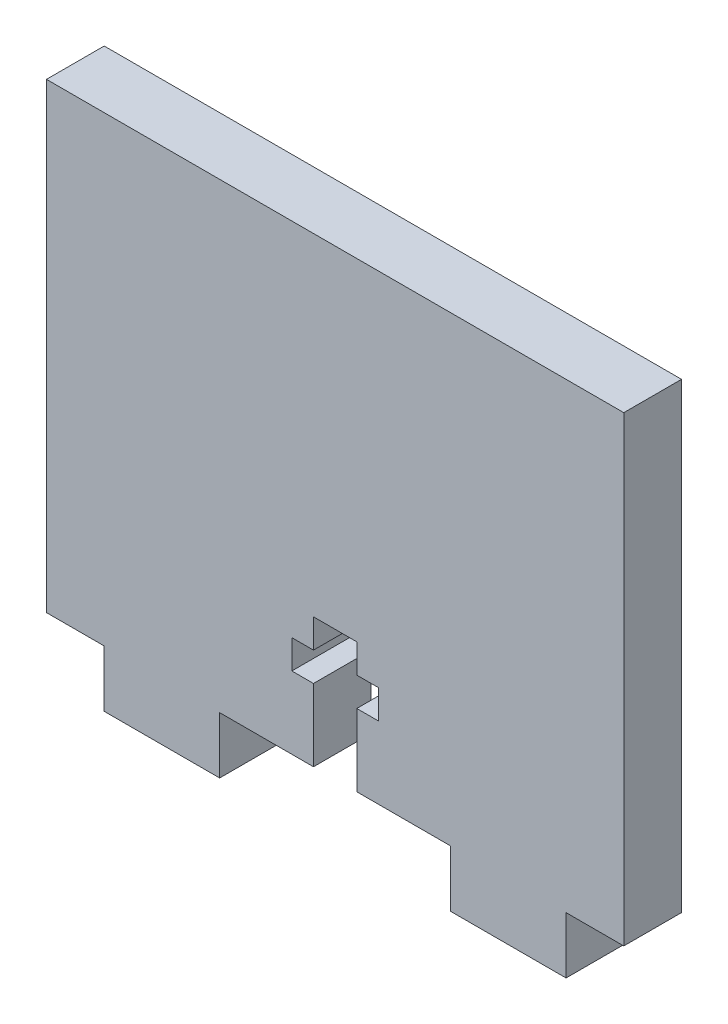
ISO-10303-21;
HEADER;
FILE_DESCRIPTION(('STEP AP214'),'2;1');
FILE_NAME('part.step','',(''),(''),'','','');
FILE_SCHEMA(('AUTOMOTIVE_DESIGN { 1 0 10303 214 1 1 1 1 }'));
ENDSEC;
DATA;
#1=APPLICATION_CONTEXT('core data for automotive mechanical design processes');
#2=APPLICATION_PROTOCOL_DEFINITION('international standard','automotive_design',2000,#1);
#3=PRODUCT_CONTEXT('',#1,'mechanical');
#4=PRODUCT('Part','Part','',(#3));
#5=PRODUCT_RELATED_PRODUCT_CATEGORY('part','',(#4));
#6=PRODUCT_DEFINITION_FORMATION('','',#4);
#7=PRODUCT_DEFINITION_CONTEXT('part definition',#1,'design');
#8=PRODUCT_DEFINITION('design','',#6,#7);
#9=PRODUCT_DEFINITION_SHAPE('','',#8);
#10=(LENGTH_UNIT() NAMED_UNIT(*) SI_UNIT(.MILLI.,.METRE.));
#11=(NAMED_UNIT(*) PLANE_ANGLE_UNIT() SI_UNIT($,.RADIAN.));
#12=(NAMED_UNIT(*) SI_UNIT($,.STERADIAN.) SOLID_ANGLE_UNIT());
#13=UNCERTAINTY_MEASURE_WITH_UNIT(LENGTH_MEASURE(1.E-05),#10,'distance_accuracy_value','');
#14=(GEOMETRIC_REPRESENTATION_CONTEXT(3) GLOBAL_UNCERTAINTY_ASSIGNED_CONTEXT((#13)) GLOBAL_UNIT_ASSIGNED_CONTEXT((#10,
#11,#12)) REPRESENTATION_CONTEXT('',''));
#15=CARTESIAN_POINT('',(0.,0.,0.));
#16=DIRECTION('',(0.,0.,1.));
#17=DIRECTION('',(1.,0.,0.));
#18=AXIS2_PLACEMENT_3D('',#15,#16,#17);
#19=CARTESIAN_POINT('',(0.,11.1125,6.35));
#20=DIRECTION('',(0.,-1.,0.));
#21=DIRECTION('',(0.,0.,-1.));
#22=AXIS2_PLACEMENT_3D('',#19,#20,#21);
#23=PLANE('',#22);
#24=DIRECTION('',(-1.,0.,0.));
#25=VECTOR('',#24,1.);
#26=CARTESIAN_POINT('',(0.,11.1125,0.));
#27=LINE('',#26,#25);
#28=CARTESIAN_POINT('',(29.36875,11.1125,0.));
#29=VERTEX_POINT('',#28);
#30=CARTESIAN_POINT('',(26.9875,11.1125,0.));
#31=VERTEX_POINT('',#30);
#32=EDGE_CURVE('E225',#29,#31,#27,.T.);
#33=ORIENTED_EDGE('',*,*,#32,.F.);
#34=DIRECTION('',(0.,0.,-1.));
#35=VECTOR('',#34,1.);
#36=CARTESIAN_POINT('',(29.36875,11.1125,6.35));
#37=LINE('',#36,#35);
#38=CARTESIAN_POINT('',(29.36875,11.1125,6.35));
#39=VERTEX_POINT('',#38);
#40=EDGE_CURVE('E11',#39,#29,#37,.T.);
#41=ORIENTED_EDGE('',*,*,#40,.F.);
#42=DIRECTION('',(-1.,0.,0.));
#43=VECTOR('',#42,1.);
#44=CARTESIAN_POINT('',(0.,11.1125,6.35));
#45=LINE('',#44,#43);
#46=CARTESIAN_POINT('',(26.9875,11.1125,6.35));
#47=VERTEX_POINT('',#46);
#48=EDGE_CURVE('E287',#39,#47,#45,.T.);
#49=ORIENTED_EDGE('',*,*,#48,.T.);
#50=DIRECTION('',(0.,0.,-1.));
#51=VECTOR('',#50,1.);
#52=CARTESIAN_POINT('',(26.9875,11.1125,6.35));
#53=LINE('',#52,#51);
#54=EDGE_CURVE('E134',#47,#31,#53,.T.);
#55=ORIENTED_EDGE('',*,*,#54,.T.);
#56=EDGE_LOOP('',(#33,#41,#49,#55));
#57=FACE_BOUND('',#56,.T.);
#58=ADVANCED_FACE('F35',(#57),#23,.T.);
#59=CARTESIAN_POINT('',(29.36875,0.,6.35));
#60=DIRECTION('',(-1.,0.,0.));
#61=DIRECTION('',(0.,0.,1.));
#62=AXIS2_PLACEMENT_3D('',#59,#60,#61);
#63=PLANE('',#62);
#64=DIRECTION('',(0.,1.,0.));
#65=VECTOR('',#64,1.);
#66=CARTESIAN_POINT('',(29.36875,0.,0.));
#67=LINE('',#66,#65);
#68=CARTESIAN_POINT('',(29.36875,14.2875,0.));
#69=VERTEX_POINT('',#68);
#70=EDGE_CURVE('E228',#29,#69,#67,.T.);
#71=ORIENTED_EDGE('',*,*,#70,.T.);
#72=DIRECTION('',(0.,0.,-1.));
#73=VECTOR('',#72,1.);
#74=CARTESIAN_POINT('',(29.36875,14.2875,6.35));
#75=LINE('',#74,#73);
#76=CARTESIAN_POINT('',(29.36875,14.2875,6.35));
#77=VERTEX_POINT('',#76);
#78=EDGE_CURVE('E43',#77,#69,#75,.T.);
#79=ORIENTED_EDGE('',*,*,#78,.F.);
#80=DIRECTION('',(0.,1.,0.));
#81=VECTOR('',#80,1.);
#82=CARTESIAN_POINT('',(29.36875,0.,6.35));
#83=LINE('',#82,#81);
#84=EDGE_CURVE('E351',#39,#77,#83,.T.);
#85=ORIENTED_EDGE('',*,*,#84,.F.);
#86=ORIENTED_EDGE('',*,*,#40,.T.);
#87=EDGE_LOOP('',(#71,#79,#85,#86));
#88=FACE_BOUND('',#87,.T.);
#89=ADVANCED_FACE('F340',(#88),#63,.F.);
#90=CARTESIAN_POINT('',(0.,14.2875,6.35));
#91=DIRECTION('',(0.,-1.,0.));
#92=DIRECTION('',(1.,0.,0.));
#93=AXIS2_PLACEMENT_3D('',#90,#91,#92);
#94=PLANE('',#93);
#95=DIRECTION('',(-1.,0.,0.));
#96=VECTOR('',#95,1.);
#97=CARTESIAN_POINT('',(0.,14.2875,0.));
#98=LINE('',#97,#96);
#99=CARTESIAN_POINT('',(34.13125,14.2875,0.));
#100=VERTEX_POINT('',#99);
#101=EDGE_CURVE('E231',#100,#69,#98,.T.);
#102=ORIENTED_EDGE('',*,*,#101,.F.);
#103=DIRECTION('',(0.,0.,-1.));
#104=VECTOR('',#103,1.);
#105=CARTESIAN_POINT('',(34.13125,14.2875,6.35));
#106=LINE('',#105,#104);
#107=CARTESIAN_POINT('',(34.13125,14.2875,6.35));
#108=VERTEX_POINT('',#107);
#109=EDGE_CURVE('E330',#108,#100,#106,.T.);
#110=ORIENTED_EDGE('',*,*,#109,.F.);
#111=DIRECTION('',(-1.,0.,0.));
#112=VECTOR('',#111,1.);
#113=CARTESIAN_POINT('',(0.,14.2875,6.35));
#114=LINE('',#113,#112);
#115=EDGE_CURVE('E337',#108,#77,#114,.T.);
#116=ORIENTED_EDGE('',*,*,#115,.T.);
#117=ORIENTED_EDGE('',*,*,#78,.T.);
#118=EDGE_LOOP('',(#102,#110,#116,#117));
#119=FACE_BOUND('',#118,.T.);
#120=ADVANCED_FACE('F335',(#119),#94,.T.);
#121=CARTESIAN_POINT('',(34.13125,0.,6.35));
#122=DIRECTION('',(-1.,0.,0.));
#123=DIRECTION('',(0.,0.,1.));
#124=AXIS2_PLACEMENT_3D('',#121,#122,#123);
#125=PLANE('',#124);
#126=DIRECTION('',(0.,1.,0.));
#127=VECTOR('',#126,1.);
#128=CARTESIAN_POINT('',(34.13125,0.,0.));
#129=LINE('',#128,#127);
#130=CARTESIAN_POINT('',(34.13125,11.1125,0.));
#131=VERTEX_POINT('',#130);
#132=EDGE_CURVE('E234',#131,#100,#129,.T.);
#133=ORIENTED_EDGE('',*,*,#132,.F.);
#134=DIRECTION('',(0.,0.,-1.));
#135=VECTOR('',#134,1.);
#136=CARTESIAN_POINT('',(34.13125,11.1125,6.35));
#137=LINE('',#136,#135);
#138=CARTESIAN_POINT('',(34.13125,11.1125,6.35));
#139=VERTEX_POINT('',#138);
#140=EDGE_CURVE('E328',#139,#131,#137,.T.);
#141=ORIENTED_EDGE('',*,*,#140,.F.);
#142=DIRECTION('',(0.,1.,0.));
#143=VECTOR('',#142,1.);
#144=CARTESIAN_POINT('',(34.13125,0.,6.35));
#145=LINE('',#144,#143);
#146=EDGE_CURVE('E350',#139,#108,#145,.T.);
#147=ORIENTED_EDGE('',*,*,#146,.T.);
#148=ORIENTED_EDGE('',*,*,#109,.T.);
#149=EDGE_LOOP('',(#133,#141,#147,#148));
#150=FACE_BOUND('',#149,.T.);
#151=ADVANCED_FACE('F346',(#150),#125,.T.);
#152=CARTESIAN_POINT('',(0.,11.1125,6.35));
#153=DIRECTION('',(0.,1.,0.));
#154=DIRECTION('',(0.,0.,1.));
#155=AXIS2_PLACEMENT_3D('',#152,#153,#154);
#156=PLANE('',#155);
#157=DIRECTION('',(1.,0.,0.));
#158=VECTOR('',#157,1.);
#159=CARTESIAN_POINT('',(0.,11.1125,0.));
#160=LINE('',#159,#158);
#161=CARTESIAN_POINT('',(36.5125,11.1125,0.));
#162=VERTEX_POINT('',#161);
#163=EDGE_CURVE('E237',#131,#162,#160,.T.);
#164=ORIENTED_EDGE('',*,*,#163,.T.);
#165=DIRECTION('',(0.,0.,-1.));
#166=VECTOR('',#165,1.);
#167=CARTESIAN_POINT('',(36.5125,11.1125,6.35));
#168=LINE('',#167,#166);
#169=CARTESIAN_POINT('',(36.5125,11.1125,6.35));
#170=VERTEX_POINT('',#169);
#171=EDGE_CURVE('E326',#170,#162,#168,.T.);
#172=ORIENTED_EDGE('',*,*,#171,.F.);
#173=DIRECTION('',(1.,0.,0.));
#174=VECTOR('',#173,1.);
#175=CARTESIAN_POINT('',(0.,11.1125,6.35));
#176=LINE('',#175,#174);
#177=EDGE_CURVE('E353',#139,#170,#176,.T.);
#178=ORIENTED_EDGE('',*,*,#177,.F.);
#179=ORIENTED_EDGE('',*,*,#140,.T.);
#180=EDGE_LOOP('',(#164,#172,#178,#179));
#181=FACE_BOUND('',#180,.T.);
#182=ADVANCED_FACE('F606',(#181),#156,.F.);
#183=CARTESIAN_POINT('',(36.5125,0.,6.35));
#184=DIRECTION('',(-1.,0.,0.));
#185=DIRECTION('',(0.,0.,1.));
#186=AXIS2_PLACEMENT_3D('',#183,#184,#185);
#187=PLANE('',#186);
#188=DIRECTION('',(0.,1.,0.));
#189=VECTOR('',#188,1.);
#190=CARTESIAN_POINT('',(36.5125,0.,0.));
#191=LINE('',#190,#189);
#192=CARTESIAN_POINT('',(36.5125,7.93749999999999,0.));
#193=VERTEX_POINT('',#192);
#194=EDGE_CURVE('E240',#193,#162,#191,.T.);
#195=ORIENTED_EDGE('',*,*,#194,.F.);
#196=DIRECTION('',(0.,0.,-1.));
#197=VECTOR('',#196,1.);
#198=CARTESIAN_POINT('',(36.5125,7.93749999999999,6.35));
#199=LINE('',#198,#197);
#200=CARTESIAN_POINT('',(36.5125,7.93749999999999,6.35));
#201=VERTEX_POINT('',#200);
#202=EDGE_CURVE('E324',#201,#193,#199,.T.);
#203=ORIENTED_EDGE('',*,*,#202,.F.);
#204=DIRECTION('',(0.,1.,0.));
#205=VECTOR('',#204,1.);
#206=CARTESIAN_POINT('',(36.5125,0.,6.35));
#207=LINE('',#206,#205);
#208=EDGE_CURVE('E359',#201,#170,#207,.T.);
#209=ORIENTED_EDGE('',*,*,#208,.T.);
#210=ORIENTED_EDGE('',*,*,#171,.T.);
#211=EDGE_LOOP('',(#195,#203,#209,#210));
#212=FACE_BOUND('',#211,.T.);
#213=ADVANCED_FACE('F596',(#212),#187,.T.);
#214=CARTESIAN_POINT('',(0.,7.93749999999999,6.35));
#215=DIRECTION('',(0.,1.,0.));
#216=DIRECTION('',(0.,0.,1.));
#217=AXIS2_PLACEMENT_3D('',#214,#215,#216);
#218=PLANE('',#217);
#219=DIRECTION('',(1.,0.,0.));
#220=VECTOR('',#219,1.);
#221=CARTESIAN_POINT('',(0.,7.93749999999999,0.));
#222=LINE('',#221,#220);
#223=CARTESIAN_POINT('',(34.13125,7.93749999999999,0.));
#224=VERTEX_POINT('',#223);
#225=EDGE_CURVE('E243',#224,#193,#222,.T.);
#226=ORIENTED_EDGE('',*,*,#225,.F.);
#227=DIRECTION('',(0.,0.,-1.));
#228=VECTOR('',#227,1.);
#229=CARTESIAN_POINT('',(34.13125,7.93749999999999,6.35));
#230=LINE('',#229,#228);
#231=CARTESIAN_POINT('',(34.13125,7.93749999999999,6.35));
#232=VERTEX_POINT('',#231);
#233=EDGE_CURVE('E322',#232,#224,#230,.T.);
#234=ORIENTED_EDGE('',*,*,#233,.F.);
#235=DIRECTION('',(1.,0.,0.));
#236=VECTOR('',#235,1.);
#237=CARTESIAN_POINT('',(0.,7.93749999999999,6.35));
#238=LINE('',#237,#236);
#239=EDGE_CURVE('E362',#232,#201,#238,.T.);
#240=ORIENTED_EDGE('',*,*,#239,.T.);
#241=ORIENTED_EDGE('',*,*,#202,.T.);
#242=EDGE_LOOP('',(#226,#234,#240,#241));
#243=FACE_BOUND('',#242,.T.);
#244=ADVANCED_FACE('F585',(#243),#218,.T.);
#245=CARTESIAN_POINT('',(34.13125,0.,6.35));
#246=DIRECTION('',(-1.,0.,0.));
#247=DIRECTION('',(0.,0.,1.));
#248=AXIS2_PLACEMENT_3D('',#245,#246,#247);
#249=PLANE('',#248);
#250=DIRECTION('',(0.,1.,0.));
#251=VECTOR('',#250,1.);
#252=CARTESIAN_POINT('',(34.13125,0.,0.));
#253=LINE('',#252,#251);
#254=CARTESIAN_POINT('',(34.13125,0.,0.));
#255=VERTEX_POINT('',#254);
#256=EDGE_CURVE('E246',#255,#224,#253,.T.);
#257=ORIENTED_EDGE('',*,*,#256,.F.);
#258=DIRECTION('',(0.,0.,-1.));
#259=VECTOR('',#258,1.);
#260=CARTESIAN_POINT('',(34.13125,0.,6.35));
#261=LINE('',#260,#259);
#262=CARTESIAN_POINT('',(34.13125,0.,6.35));
#263=VERTEX_POINT('',#262);
#264=EDGE_CURVE('E320',#263,#255,#261,.T.);
#265=ORIENTED_EDGE('',*,*,#264,.F.);
#266=DIRECTION('',(0.,1.,0.));
#267=VECTOR('',#266,1.);
#268=CARTESIAN_POINT('',(34.13125,0.,6.35));
#269=LINE('',#268,#267);
#270=EDGE_CURVE('E365',#263,#232,#269,.T.);
#271=ORIENTED_EDGE('',*,*,#270,.T.);
#272=ORIENTED_EDGE('',*,*,#233,.T.);
#273=EDGE_LOOP('',(#257,#265,#271,#272));
#274=FACE_BOUND('',#273,.T.);
#275=ADVANCED_FACE('F575',(#274),#249,.T.);
#276=CARTESIAN_POINT('',(0.,0.,6.35));
#277=DIRECTION('',(0.,1.,0.));
#278=DIRECTION('',(-1.,0.,0.));
#279=AXIS2_PLACEMENT_3D('',#276,#277,#278);
#280=PLANE('',#279);
#281=DIRECTION('',(1.,0.,0.));
#282=VECTOR('',#281,1.);
#283=CARTESIAN_POINT('',(0.,0.,0.));
#284=LINE('',#283,#282);
#285=CARTESIAN_POINT('',(44.45,0.,0.));
#286=VERTEX_POINT('',#285);
#287=EDGE_CURVE('E249',#255,#286,#284,.T.);
#288=ORIENTED_EDGE('',*,*,#287,.T.);
#289=DIRECTION('',(0.,0.,-1.));
#290=VECTOR('',#289,1.);
#291=CARTESIAN_POINT('',(44.45,0.,6.35));
#292=LINE('',#291,#290);
#293=CARTESIAN_POINT('',(44.45,0.,6.35));
#294=VERTEX_POINT('',#293);
#295=EDGE_CURVE('E317',#294,#286,#292,.T.);
#296=ORIENTED_EDGE('',*,*,#295,.F.);
#297=DIRECTION('',(1.,0.,0.));
#298=VECTOR('',#297,1.);
#299=CARTESIAN_POINT('',(0.,0.,6.35));
#300=LINE('',#299,#298);
#301=EDGE_CURVE('E368',#263,#294,#300,.T.);
#302=ORIENTED_EDGE('',*,*,#301,.F.);
#303=ORIENTED_EDGE('',*,*,#264,.T.);
#304=EDGE_LOOP('',(#288,#296,#302,#303));
#305=FACE_BOUND('',#304,.T.);
#306=ADVANCED_FACE('F565',(#305),#280,.F.);
#307=CARTESIAN_POINT('',(44.45,0.,6.35));
#308=DIRECTION('',(1.,0.,0.));
#309=DIRECTION('',(0.,0.,-1.));
#310=AXIS2_PLACEMENT_3D('',#307,#308,#309);
#311=PLANE('',#310);
#312=DIRECTION('',(0.,-1.,0.));
#313=VECTOR('',#312,1.);
#314=CARTESIAN_POINT('',(44.45,0.,0.));
#315=LINE('',#314,#313);
#316=CARTESIAN_POINT('',(44.45,-6.22788461538458,0.));
#317=VERTEX_POINT('',#316);
#318=EDGE_CURVE('E251',#286,#317,#315,.T.);
#319=ORIENTED_EDGE('',*,*,#318,.T.);
#320=DIRECTION('',(0.,0.,-1.));
#321=VECTOR('',#320,1.);
#322=CARTESIAN_POINT('',(44.45,-6.22788461538458,6.35));
#323=LINE('',#322,#321);
#324=CARTESIAN_POINT('',(44.45,-6.22788461538458,6.35));
#325=VERTEX_POINT('',#324);
#326=EDGE_CURVE('E314',#325,#317,#323,.T.);
#327=ORIENTED_EDGE('',*,*,#326,.F.);
#328=DIRECTION('',(0.,-1.,0.));
#329=VECTOR('',#328,1.);
#330=CARTESIAN_POINT('',(44.45,0.,6.35));
#331=LINE('',#330,#329);
#332=EDGE_CURVE('E370',#294,#325,#331,.T.);
#333=ORIENTED_EDGE('',*,*,#332,.F.);
#334=ORIENTED_EDGE('',*,*,#295,.T.);
#335=EDGE_LOOP('',(#319,#327,#333,#334));
#336=FACE_BOUND('',#335,.T.);
#337=ADVANCED_FACE('F555',(#336),#311,.F.);
#338=CARTESIAN_POINT('',(0.,-6.22788461538458,6.35));
#339=DIRECTION('',(0.,1.,0.));
#340=DIRECTION('',(0.,0.,1.));
#341=AXIS2_PLACEMENT_3D('',#338,#339,#340);
#342=PLANE('',#341);
#343=DIRECTION('',(1.,0.,0.));
#344=VECTOR('',#343,1.);
#345=CARTESIAN_POINT('',(0.,-6.22788461538458,0.));
#346=LINE('',#345,#344);
#347=CARTESIAN_POINT('',(57.15,-6.22788461538458,0.));
#348=VERTEX_POINT('',#347);
#349=EDGE_CURVE('E253',#317,#348,#346,.T.);
#350=ORIENTED_EDGE('',*,*,#349,.T.);
#351=DIRECTION('',(0.,0.,-1.));
#352=VECTOR('',#351,1.);
#353=CARTESIAN_POINT('',(57.15,-6.22788461538458,6.35));
#354=LINE('',#353,#352);
#355=CARTESIAN_POINT('',(57.15,-6.22788461538458,6.35));
#356=VERTEX_POINT('',#355);
#357=EDGE_CURVE('E312',#356,#348,#354,.T.);
#358=ORIENTED_EDGE('',*,*,#357,.F.);
#359=DIRECTION('',(1.,0.,0.));
#360=VECTOR('',#359,1.);
#361=CARTESIAN_POINT('',(0.,-6.22788461538458,6.35));
#362=LINE('',#361,#360);
#363=EDGE_CURVE('E372',#325,#356,#362,.T.);
#364=ORIENTED_EDGE('',*,*,#363,.F.);
#365=ORIENTED_EDGE('',*,*,#326,.T.);
#366=EDGE_LOOP('',(#350,#358,#364,#365));
#367=FACE_BOUND('',#366,.T.);
#368=ADVANCED_FACE('F545',(#367),#342,.F.);
#369=CARTESIAN_POINT('',(57.15,0.,6.35));
#370=DIRECTION('',(1.,0.,0.));
#371=DIRECTION('',(0.,0.,-1.));
#372=AXIS2_PLACEMENT_3D('',#369,#370,#371);
#373=PLANE('',#372);
#374=DIRECTION('',(0.,-1.,0.));
#375=VECTOR('',#374,1.);
#376=CARTESIAN_POINT('',(57.15,0.,0.));
#377=LINE('',#376,#375);
#378=CARTESIAN_POINT('',(57.15,0.,0.));
#379=VERTEX_POINT('',#378);
#380=EDGE_CURVE('E256',#379,#348,#377,.T.);
#381=ORIENTED_EDGE('',*,*,#380,.F.);
#382=DIRECTION('',(0.,0.,-1.));
#383=VECTOR('',#382,1.);
#384=CARTESIAN_POINT('',(57.15,0.,6.35));
#385=LINE('',#384,#383);
#386=CARTESIAN_POINT('',(57.15,0.,6.35));
#387=VERTEX_POINT('',#386);
#388=EDGE_CURVE('E310',#387,#379,#385,.T.);
#389=ORIENTED_EDGE('',*,*,#388,.F.);
#390=DIRECTION('',(0.,-1.,0.));
#391=VECTOR('',#390,1.);
#392=CARTESIAN_POINT('',(57.15,0.,6.35));
#393=LINE('',#392,#391);
#394=EDGE_CURVE('E374',#387,#356,#393,.T.);
#395=ORIENTED_EDGE('',*,*,#394,.T.);
#396=ORIENTED_EDGE('',*,*,#357,.T.);
#397=EDGE_LOOP('',(#381,#389,#395,#396));
#398=FACE_BOUND('',#397,.T.);
#399=ADVANCED_FACE('F535',(#398),#373,.T.);
#400=CARTESIAN_POINT('',(0.,0.,6.35));
#401=DIRECTION('',(0.,1.,0.));
#402=DIRECTION('',(0.,0.,1.));
#403=AXIS2_PLACEMENT_3D('',#400,#401,#402);
#404=PLANE('',#403);
#405=DIRECTION('',(1.,0.,0.));
#406=VECTOR('',#405,1.);
#407=CARTESIAN_POINT('',(0.,0.,0.));
#408=LINE('',#407,#406);
#409=CARTESIAN_POINT('',(63.5,0.,0.));
#410=VERTEX_POINT('',#409);
#411=EDGE_CURVE('E259',#379,#410,#408,.T.);
#412=ORIENTED_EDGE('',*,*,#411,.T.);
#413=DIRECTION('',(0.,0.,-1.));
#414=VECTOR('',#413,1.);
#415=CARTESIAN_POINT('',(63.5,0.,6.35));
#416=LINE('',#415,#414);
#417=CARTESIAN_POINT('',(63.5,0.,6.35));
#418=VERTEX_POINT('',#417);
#419=EDGE_CURVE('E307',#418,#410,#416,.T.);
#420=ORIENTED_EDGE('',*,*,#419,.F.);
#421=DIRECTION('',(1.,0.,0.));
#422=VECTOR('',#421,1.);
#423=CARTESIAN_POINT('',(0.,0.,6.35));
#424=LINE('',#423,#422);
#425=EDGE_CURVE('E377',#387,#418,#424,.T.);
#426=ORIENTED_EDGE('',*,*,#425,.F.);
#427=ORIENTED_EDGE('',*,*,#388,.T.);
#428=EDGE_LOOP('',(#412,#420,#426,#427));
#429=FACE_BOUND('',#428,.T.);
#430=ADVANCED_FACE('F525',(#429),#404,.F.);
#431=CARTESIAN_POINT('',(63.5,0.,6.35));
#432=DIRECTION('',(-1.,0.,0.));
#433=DIRECTION('',(0.,0.,1.));
#434=AXIS2_PLACEMENT_3D('',#431,#432,#433);
#435=PLANE('',#434);
#436=DIRECTION('',(0.,1.,0.));
#437=VECTOR('',#436,1.);
#438=CARTESIAN_POINT('',(63.5,0.,0.));
#439=LINE('',#438,#437);
#440=CARTESIAN_POINT('',(63.5,50.8,0.));
#441=VERTEX_POINT('',#440);
#442=EDGE_CURVE('E261',#410,#441,#439,.T.);
#443=ORIENTED_EDGE('',*,*,#442,.T.);
#444=DIRECTION('',(0.,0.,-1.));
#445=VECTOR('',#444,1.);
#446=CARTESIAN_POINT('',(63.5,50.8,6.35));
#447=LINE('',#446,#445);
#448=CARTESIAN_POINT('',(63.5,50.8,6.35));
#449=VERTEX_POINT('',#448);
#450=EDGE_CURVE('E305',#449,#441,#447,.T.);
#451=ORIENTED_EDGE('',*,*,#450,.F.);
#452=DIRECTION('',(0.,1.,0.));
#453=VECTOR('',#452,1.);
#454=CARTESIAN_POINT('',(63.5,0.,6.35));
#455=LINE('',#454,#453);
#456=EDGE_CURVE('E379',#418,#449,#455,.T.);
#457=ORIENTED_EDGE('',*,*,#456,.F.);
#458=ORIENTED_EDGE('',*,*,#419,.T.);
#459=EDGE_LOOP('',(#443,#451,#457,#458));
#460=FACE_BOUND('',#459,.T.);
#461=ADVANCED_FACE('F515',(#460),#435,.F.);
#462=CARTESIAN_POINT('',(0.,50.8,6.35));
#463=DIRECTION('',(0.,1.,0.));
#464=DIRECTION('',(0.,0.,1.));
#465=AXIS2_PLACEMENT_3D('',#462,#463,#464);
#466=PLANE('',#465);
#467=DIRECTION('',(1.,0.,0.));
#468=VECTOR('',#467,1.);
#469=CARTESIAN_POINT('',(0.,50.8,0.));
#470=LINE('',#469,#468);
#471=CARTESIAN_POINT('',(0.,50.8,0.));
#472=VERTEX_POINT('',#471);
#473=EDGE_CURVE('E265',#472,#441,#470,.T.);
#474=ORIENTED_EDGE('',*,*,#473,.F.);
#475=DIRECTION('',(0.,0.,-1.));
#476=VECTOR('',#475,1.);
#477=CARTESIAN_POINT('',(0.,50.8,6.35));
#478=LINE('',#477,#476);
#479=CARTESIAN_POINT('',(0.,50.8,6.35));
#480=VERTEX_POINT('',#479);
#481=EDGE_CURVE('E303',#480,#472,#478,.T.);
#482=ORIENTED_EDGE('',*,*,#481,.F.);
#483=DIRECTION('',(1.,0.,0.));
#484=VECTOR('',#483,1.);
#485=CARTESIAN_POINT('',(0.,50.8,6.35));
#486=LINE('',#485,#484);
#487=EDGE_CURVE('E381',#480,#449,#486,.T.);
#488=ORIENTED_EDGE('',*,*,#487,.T.);
#489=ORIENTED_EDGE('',*,*,#450,.T.);
#490=EDGE_LOOP('',(#474,#482,#488,#489));
#491=FACE_BOUND('',#490,.T.);
#492=ADVANCED_FACE('F505',(#491),#466,.T.);
#493=CARTESIAN_POINT('',(0.,0.,6.35));
#494=DIRECTION('',(-1.,0.,0.));
#495=DIRECTION('',(0.,0.,1.));
#496=AXIS2_PLACEMENT_3D('',#493,#494,#495);
#497=PLANE('',#496);
#498=DIRECTION('',(0.,1.,0.));
#499=VECTOR('',#498,1.);
#500=CARTESIAN_POINT('',(0.,0.,0.));
#501=LINE('',#500,#499);
#502=CARTESIAN_POINT('',(0.,0.,0.));
#503=VERTEX_POINT('',#502);
#504=EDGE_CURVE('E268',#503,#472,#501,.T.);
#505=ORIENTED_EDGE('',*,*,#504,.F.);
#506=DIRECTION('',(0.,0.,-1.));
#507=VECTOR('',#506,1.);
#508=CARTESIAN_POINT('',(0.,0.,6.35));
#509=LINE('',#508,#507);
#510=CARTESIAN_POINT('',(0.,0.,6.35));
#511=VERTEX_POINT('',#510);
#512=EDGE_CURVE('E301',#511,#503,#509,.T.);
#513=ORIENTED_EDGE('',*,*,#512,.F.);
#514=DIRECTION('',(0.,1.,0.));
#515=VECTOR('',#514,1.);
#516=CARTESIAN_POINT('',(0.,0.,6.35));
#517=LINE('',#516,#515);
#518=EDGE_CURVE('E384',#511,#480,#517,.T.);
#519=ORIENTED_EDGE('',*,*,#518,.T.);
#520=ORIENTED_EDGE('',*,*,#481,.T.);
#521=EDGE_LOOP('',(#505,#513,#519,#520));
#522=FACE_BOUND('',#521,.T.);
#523=ADVANCED_FACE('F495',(#522),#497,.T.);
#524=CARTESIAN_POINT('',(0.,0.,6.35));
#525=DIRECTION('',(0.,1.,0.));
#526=DIRECTION('',(0.,0.,1.));
#527=AXIS2_PLACEMENT_3D('',#524,#525,#526);
#528=PLANE('',#527);
#529=DIRECTION('',(1.,0.,0.));
#530=VECTOR('',#529,1.);
#531=CARTESIAN_POINT('',(0.,0.,0.));
#532=LINE('',#531,#530);
#533=CARTESIAN_POINT('',(6.35,0.,0.));
#534=VERTEX_POINT('',#533);
#535=EDGE_CURVE('E271',#503,#534,#532,.T.);
#536=ORIENTED_EDGE('',*,*,#535,.T.);
#537=DIRECTION('',(0.,0.,-1.));
#538=VECTOR('',#537,1.);
#539=CARTESIAN_POINT('',(6.35,0.,6.35));
#540=LINE('',#539,#538);
#541=CARTESIAN_POINT('',(6.35,0.,6.35));
#542=VERTEX_POINT('',#541);
#543=EDGE_CURVE('E298',#542,#534,#540,.T.);
#544=ORIENTED_EDGE('',*,*,#543,.F.);
#545=DIRECTION('',(1.,0.,0.));
#546=VECTOR('',#545,1.);
#547=CARTESIAN_POINT('',(0.,0.,6.35));
#548=LINE('',#547,#546);
#549=EDGE_CURVE('E387',#511,#542,#548,.T.);
#550=ORIENTED_EDGE('',*,*,#549,.F.);
#551=ORIENTED_EDGE('',*,*,#512,.T.);
#552=EDGE_LOOP('',(#536,#544,#550,#551));
#553=FACE_BOUND('',#552,.T.);
#554=ADVANCED_FACE('F485',(#553),#528,.F.);
#555=CARTESIAN_POINT('',(6.35,0.,6.35));
#556=DIRECTION('',(1.,0.,0.));
#557=DIRECTION('',(0.,1.,0.));
#558=AXIS2_PLACEMENT_3D('',#555,#556,#557);
#559=PLANE('',#558);
#560=DIRECTION('',(0.,-1.,0.));
#561=VECTOR('',#560,1.);
#562=CARTESIAN_POINT('',(6.35,0.,0.));
#563=LINE('',#562,#561);
#564=CARTESIAN_POINT('',(6.35,-6.22788461538458,0.));
#565=VERTEX_POINT('',#564);
#566=EDGE_CURVE('E273',#534,#565,#563,.T.);
#567=ORIENTED_EDGE('',*,*,#566,.T.);
#568=DIRECTION('',(0.,0.,-1.));
#569=VECTOR('',#568,1.);
#570=CARTESIAN_POINT('',(6.35,-6.22788461538458,6.35));
#571=LINE('',#570,#569);
#572=CARTESIAN_POINT('',(6.35,-6.22788461538458,6.35));
#573=VERTEX_POINT('',#572);
#574=EDGE_CURVE('E295',#573,#565,#571,.T.);
#575=ORIENTED_EDGE('',*,*,#574,.F.);
#576=DIRECTION('',(0.,-1.,0.));
#577=VECTOR('',#576,1.);
#578=CARTESIAN_POINT('',(6.35,0.,6.35));
#579=LINE('',#578,#577);
#580=EDGE_CURVE('E389',#542,#573,#579,.T.);
#581=ORIENTED_EDGE('',*,*,#580,.F.);
#582=ORIENTED_EDGE('',*,*,#543,.T.);
#583=EDGE_LOOP('',(#567,#575,#581,#582));
#584=FACE_BOUND('',#583,.T.);
#585=ADVANCED_FACE('F476',(#584),#559,.F.);
#586=CARTESIAN_POINT('',(0.,-6.22788461538458,6.35));
#587=DIRECTION('',(0.,1.,0.));
#588=DIRECTION('',(0.,0.,1.));
#589=AXIS2_PLACEMENT_3D('',#586,#587,#588);
#590=PLANE('',#589);
#591=DIRECTION('',(1.,0.,0.));
#592=VECTOR('',#591,1.);
#593=CARTESIAN_POINT('',(0.,-6.22788461538458,0.));
#594=LINE('',#593,#592);
#595=CARTESIAN_POINT('',(19.05,-6.22788461538458,0.));
#596=VERTEX_POINT('',#595);
#597=EDGE_CURVE('E275',#565,#596,#594,.T.);
#598=ORIENTED_EDGE('',*,*,#597,.T.);
#599=DIRECTION('',(0.,0.,-1.));
#600=VECTOR('',#599,1.);
#601=CARTESIAN_POINT('',(19.05,-6.22788461538458,6.35));
#602=LINE('',#601,#600);
#603=CARTESIAN_POINT('',(19.05,-6.22788461538458,6.35));
#604=VERTEX_POINT('',#603);
#605=EDGE_CURVE('E293',#604,#596,#602,.T.);
#606=ORIENTED_EDGE('',*,*,#605,.F.);
#607=DIRECTION('',(1.,0.,0.));
#608=VECTOR('',#607,1.);
#609=CARTESIAN_POINT('',(0.,-6.22788461538458,6.35));
#610=LINE('',#609,#608);
#611=EDGE_CURVE('E391',#573,#604,#610,.T.);
#612=ORIENTED_EDGE('',*,*,#611,.F.);
#613=ORIENTED_EDGE('',*,*,#574,.T.);
#614=EDGE_LOOP('',(#598,#606,#612,#613));
#615=FACE_BOUND('',#614,.T.);
#616=ADVANCED_FACE('F403',(#615),#590,.F.);
#617=CARTESIAN_POINT('',(19.05,0.,6.35));
#618=DIRECTION('',(1.,0.,0.));
#619=DIRECTION('',(0.,1.,0.));
#620=AXIS2_PLACEMENT_3D('',#617,#618,#619);
#621=PLANE('',#620);
#622=DIRECTION('',(0.,-1.,0.));
#623=VECTOR('',#622,1.);
#624=CARTESIAN_POINT('',(19.05,0.,0.));
#625=LINE('',#624,#623);
#626=CARTESIAN_POINT('',(19.05,0.,0.));
#627=VERTEX_POINT('',#626);
#628=EDGE_CURVE('E278',#627,#596,#625,.T.);
#629=ORIENTED_EDGE('',*,*,#628,.F.);
#630=DIRECTION('',(0.,0.,-1.));
#631=VECTOR('',#630,1.);
#632=CARTESIAN_POINT('',(19.05,0.,6.35));
#633=LINE('',#632,#631);
#634=CARTESIAN_POINT('',(19.05,0.,6.35));
#635=VERTEX_POINT('',#634);
#636=EDGE_CURVE('E291',#635,#627,#633,.T.);
#637=ORIENTED_EDGE('',*,*,#636,.F.);
#638=DIRECTION('',(0.,-1.,0.));
#639=VECTOR('',#638,1.);
#640=CARTESIAN_POINT('',(19.05,0.,6.35));
#641=LINE('',#640,#639);
#642=EDGE_CURVE('E393',#635,#604,#641,.T.);
#643=ORIENTED_EDGE('',*,*,#642,.T.);
#644=ORIENTED_EDGE('',*,*,#605,.T.);
#645=EDGE_LOOP('',(#629,#637,#643,#644));
#646=FACE_BOUND('',#645,.T.);
#647=ADVANCED_FACE('F397',(#646),#621,.T.);
#648=CARTESIAN_POINT('',(0.,0.,6.35));
#649=DIRECTION('',(0.,1.,0.));
#650=DIRECTION('',(-1.,0.,0.));
#651=AXIS2_PLACEMENT_3D('',#648,#649,#650);
#652=PLANE('',#651);
#653=DIRECTION('',(1.,0.,0.));
#654=VECTOR('',#653,1.);
#655=CARTESIAN_POINT('',(0.,0.,0.));
#656=LINE('',#655,#654);
#657=CARTESIAN_POINT('',(29.36875,0.,0.));
#658=VERTEX_POINT('',#657);
#659=EDGE_CURVE('E281',#627,#658,#656,.T.);
#660=ORIENTED_EDGE('',*,*,#659,.T.);
#661=DIRECTION('',(0.,0.,-1.));
#662=VECTOR('',#661,1.);
#663=CARTESIAN_POINT('',(29.36875,0.,6.35));
#664=LINE('',#663,#662);
#665=CARTESIAN_POINT('',(29.36875,0.,6.35));
#666=VERTEX_POINT('',#665);
#667=EDGE_CURVE('E217',#666,#658,#664,.T.);
#668=ORIENTED_EDGE('',*,*,#667,.F.);
#669=DIRECTION('',(1.,0.,0.));
#670=VECTOR('',#669,1.);
#671=CARTESIAN_POINT('',(0.,0.,6.35));
#672=LINE('',#671,#670);
#673=EDGE_CURVE('E208',#635,#666,#672,.T.);
#674=ORIENTED_EDGE('',*,*,#673,.F.);
#675=ORIENTED_EDGE('',*,*,#636,.T.);
#676=EDGE_LOOP('',(#660,#668,#674,#675));
#677=FACE_BOUND('',#676,.T.);
#678=ADVANCED_FACE('F408',(#677),#652,.F.);
#679=CARTESIAN_POINT('',(29.36875,0.,6.35));
#680=DIRECTION('',(-1.,0.,0.));
#681=DIRECTION('',(0.,0.,1.));
#682=AXIS2_PLACEMENT_3D('',#679,#680,#681);
#683=PLANE('',#682);
#684=DIRECTION('',(0.,1.,0.));
#685=VECTOR('',#684,1.);
#686=CARTESIAN_POINT('',(29.36875,0.,0.));
#687=LINE('',#686,#685);
#688=CARTESIAN_POINT('',(29.36875,7.9375,0.));
#689=VERTEX_POINT('',#688);
#690=EDGE_CURVE('E216',#658,#689,#687,.T.);
#691=ORIENTED_EDGE('',*,*,#690,.T.);
#692=DIRECTION('',(0.,0.,-1.));
#693=VECTOR('',#692,1.);
#694=CARTESIAN_POINT('',(29.36875,7.9375,6.35));
#695=LINE('',#694,#693);
#696=CARTESIAN_POINT('',(29.36875,7.9375,6.35));
#697=VERTEX_POINT('',#696);
#698=EDGE_CURVE('E213',#697,#689,#695,.T.);
#699=ORIENTED_EDGE('',*,*,#698,.F.);
#700=DIRECTION('',(0.,1.,0.));
#701=VECTOR('',#700,1.);
#702=CARTESIAN_POINT('',(29.36875,0.,6.35));
#703=LINE('',#702,#701);
#704=EDGE_CURVE('E201',#666,#697,#703,.T.);
#705=ORIENTED_EDGE('',*,*,#704,.F.);
#706=ORIENTED_EDGE('',*,*,#667,.T.);
#707=EDGE_LOOP('',(#691,#699,#705,#706));
#708=FACE_BOUND('',#707,.T.);
#709=ADVANCED_FACE('F214',(#708),#683,.F.);
#710=CARTESIAN_POINT('',(0.,7.9375,6.35));
#711=DIRECTION('',(0.,-1.,0.));
#712=DIRECTION('',(0.,0.,-1.));
#713=AXIS2_PLACEMENT_3D('',#710,#711,#712);
#714=PLANE('',#713);
#715=DIRECTION('',(-1.,0.,0.));
#716=VECTOR('',#715,1.);
#717=CARTESIAN_POINT('',(0.,7.9375,0.));
#718=LINE('',#717,#716);
#719=CARTESIAN_POINT('',(26.9875,7.9375,0.));
#720=VERTEX_POINT('',#719);
#721=EDGE_CURVE('E127',#689,#720,#718,.T.);
#722=ORIENTED_EDGE('',*,*,#721,.T.);
#723=DIRECTION('',(0.,0.,-1.));
#724=VECTOR('',#723,1.);
#725=CARTESIAN_POINT('',(26.9875,7.9375,6.35));
#726=LINE('',#725,#724);
#727=CARTESIAN_POINT('',(26.9875,7.9375,6.35));
#728=VERTEX_POINT('',#727);
#729=EDGE_CURVE('E218',#728,#720,#726,.T.);
#730=ORIENTED_EDGE('',*,*,#729,.F.);
#731=DIRECTION('',(-1.,0.,0.));
#732=VECTOR('',#731,1.);
#733=CARTESIAN_POINT('',(0.,7.9375,6.35));
#734=LINE('',#733,#732);
#735=EDGE_CURVE('E205',#697,#728,#734,.T.);
#736=ORIENTED_EDGE('',*,*,#735,.F.);
#737=ORIENTED_EDGE('',*,*,#698,.T.);
#738=EDGE_LOOP('',(#722,#730,#736,#737));
#739=FACE_BOUND('',#738,.T.);
#740=ADVANCED_FACE('F220',(#739),#714,.F.);
#741=CARTESIAN_POINT('',(26.9875,0.,6.35));
#742=DIRECTION('',(-1.,0.,0.));
#743=DIRECTION('',(0.,0.,1.));
#744=AXIS2_PLACEMENT_3D('',#741,#742,#743);
#745=PLANE('',#744);
#746=DIRECTION('',(0.,1.,0.));
#747=VECTOR('',#746,1.);
#748=CARTESIAN_POINT('',(26.9875,0.,0.));
#749=LINE('',#748,#747);
#750=EDGE_CURVE('E285',#720,#31,#749,.T.);
#751=ORIENTED_EDGE('',*,*,#750,.T.);
#752=ORIENTED_EDGE('',*,*,#54,.F.);
#753=DIRECTION('',(0.,1.,0.));
#754=VECTOR('',#753,1.);
#755=CARTESIAN_POINT('',(26.9875,0.,6.35));
#756=LINE('',#755,#754);
#757=EDGE_CURVE('E51',#728,#47,#756,.T.);
#758=ORIENTED_EDGE('',*,*,#757,.F.);
#759=ORIENTED_EDGE('',*,*,#729,.T.);
#760=EDGE_LOOP('',(#751,#752,#758,#759));
#761=FACE_BOUND('',#760,.T.);
#762=ADVANCED_FACE('F423',(#761),#745,.F.);
#763=CARTESIAN_POINT('',(0.,0.,6.35));
#764=DIRECTION('',(0.,0.,1.));
#765=DIRECTION('',(1.,0.,0.));
#766=AXIS2_PLACEMENT_3D('',#763,#764,#765);
#767=PLANE('',#766);
#768=ORIENTED_EDGE('',*,*,#48,.F.);
#769=ORIENTED_EDGE('',*,*,#84,.T.);
#770=ORIENTED_EDGE('',*,*,#115,.F.);
#771=ORIENTED_EDGE('',*,*,#146,.F.);
#772=ORIENTED_EDGE('',*,*,#177,.T.);
#773=ORIENTED_EDGE('',*,*,#208,.F.);
#774=ORIENTED_EDGE('',*,*,#239,.F.);
#775=ORIENTED_EDGE('',*,*,#270,.F.);
#776=ORIENTED_EDGE('',*,*,#301,.T.);
#777=ORIENTED_EDGE('',*,*,#332,.T.);
#778=ORIENTED_EDGE('',*,*,#363,.T.);
#779=ORIENTED_EDGE('',*,*,#394,.F.);
#780=ORIENTED_EDGE('',*,*,#425,.T.);
#781=ORIENTED_EDGE('',*,*,#456,.T.);
#782=ORIENTED_EDGE('',*,*,#487,.F.);
#783=ORIENTED_EDGE('',*,*,#518,.F.);
#784=ORIENTED_EDGE('',*,*,#549,.T.);
#785=ORIENTED_EDGE('',*,*,#580,.T.);
#786=ORIENTED_EDGE('',*,*,#611,.T.);
#787=ORIENTED_EDGE('',*,*,#642,.F.);
#788=ORIENTED_EDGE('',*,*,#673,.T.);
#789=ORIENTED_EDGE('',*,*,#704,.T.);
#790=ORIENTED_EDGE('',*,*,#735,.T.);
#791=ORIENTED_EDGE('',*,*,#757,.T.);
#792=EDGE_LOOP('',(#768,#769,#770,#771,#772,#773,#774,#775,#776,#777,#778,#779,#780,#781,#782,
#783,#784,#785,#786,#787,#788,#789,#790,#791));
#793=FACE_BOUND('',#792,.T.);
#794=ADVANCED_FACE('F203',(#793),#767,.T.);
#795=CARTESIAN_POINT('',(0.,0.,0.));
#796=DIRECTION('',(0.,0.,1.));
#797=DIRECTION('',(1.,0.,0.));
#798=AXIS2_PLACEMENT_3D('',#795,#796,#797);
#799=PLANE('',#798);
#800=ORIENTED_EDGE('',*,*,#32,.T.);
#801=ORIENTED_EDGE('',*,*,#750,.F.);
#802=ORIENTED_EDGE('',*,*,#721,.F.);
#803=ORIENTED_EDGE('',*,*,#690,.F.);
#804=ORIENTED_EDGE('',*,*,#659,.F.);
#805=ORIENTED_EDGE('',*,*,#628,.T.);
#806=ORIENTED_EDGE('',*,*,#597,.F.);
#807=ORIENTED_EDGE('',*,*,#566,.F.);
#808=ORIENTED_EDGE('',*,*,#535,.F.);
#809=ORIENTED_EDGE('',*,*,#504,.T.);
#810=ORIENTED_EDGE('',*,*,#473,.T.);
#811=ORIENTED_EDGE('',*,*,#442,.F.);
#812=ORIENTED_EDGE('',*,*,#411,.F.);
#813=ORIENTED_EDGE('',*,*,#380,.T.);
#814=ORIENTED_EDGE('',*,*,#349,.F.);
#815=ORIENTED_EDGE('',*,*,#318,.F.);
#816=ORIENTED_EDGE('',*,*,#287,.F.);
#817=ORIENTED_EDGE('',*,*,#256,.T.);
#818=ORIENTED_EDGE('',*,*,#225,.T.);
#819=ORIENTED_EDGE('',*,*,#194,.T.);
#820=ORIENTED_EDGE('',*,*,#163,.F.);
#821=ORIENTED_EDGE('',*,*,#132,.T.);
#822=ORIENTED_EDGE('',*,*,#101,.T.);
#823=ORIENTED_EDGE('',*,*,#70,.F.);
#824=EDGE_LOOP('',(#800,#801,#802,#803,#804,#805,#806,#807,#808,#809,#810,#811,#812,#813,#814,
#815,#816,#817,#818,#819,#820,#821,#822,#823));
#825=FACE_BOUND('',#824,.T.);
#826=ADVANCED_FACE('F342',(#825),#799,.F.);
#827=CLOSED_SHELL('',(#58,#89,#120,#151,#182,#213,#244,#275,#306,#337,#368,#399,#430,#461,#492,
#523,#554,#585,#616,#647,#678,#709,#740,#762,#794,#826));
#828=MANIFOLD_SOLID_BREP('B2',#827);
#829=ADVANCED_BREP_SHAPE_REPRESENTATION('',(#18,#828),#14);
#830=SHAPE_DEFINITION_REPRESENTATION(#9,#829);
ENDSEC;
END-ISO-10303-21;
